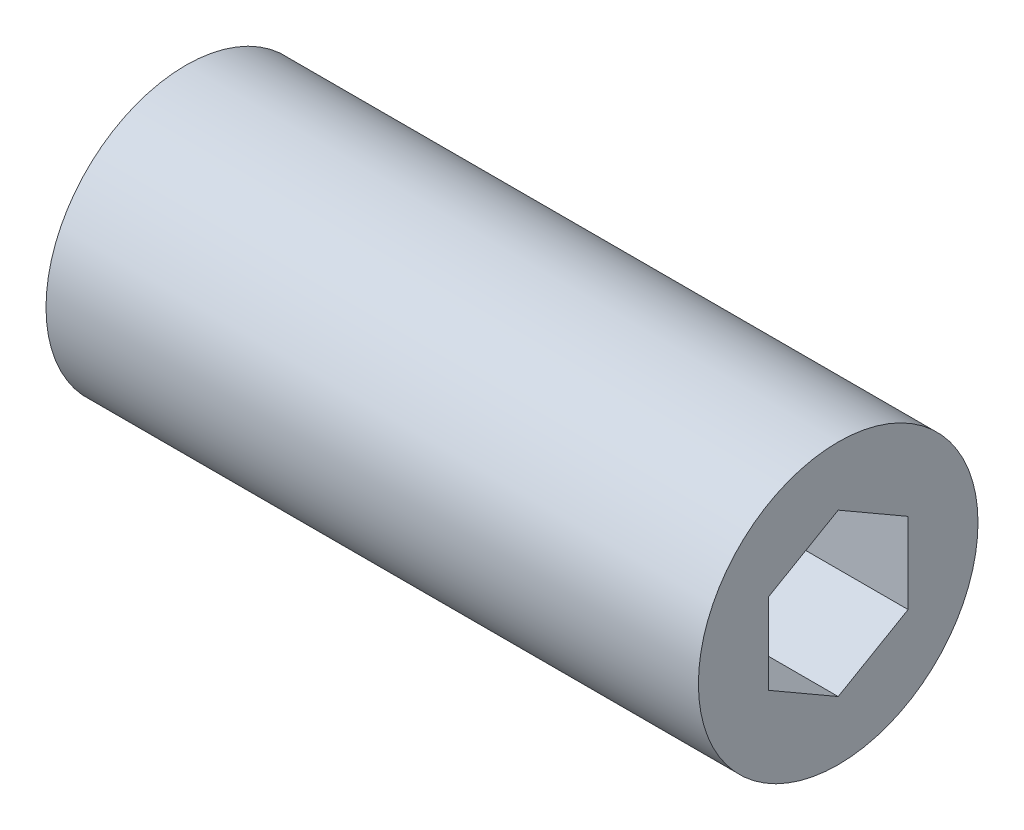
ISO-10303-21;
HEADER;
FILE_DESCRIPTION(('STEP AP214'),'2;1');
FILE_NAME('part.step','',(''),(''),'','','');
FILE_SCHEMA(('AUTOMOTIVE_DESIGN { 1 0 10303 214 1 1 1 1 }'));
ENDSEC;
DATA;
#1=APPLICATION_CONTEXT('core data for automotive mechanical design processes');
#2=APPLICATION_PROTOCOL_DEFINITION('international standard','automotive_design',2000,#1);
#3=PRODUCT_CONTEXT('',#1,'mechanical');
#4=PRODUCT('Part','Part','',(#3));
#5=PRODUCT_RELATED_PRODUCT_CATEGORY('part','',(#4));
#6=PRODUCT_DEFINITION_FORMATION('','',#4);
#7=PRODUCT_DEFINITION_CONTEXT('part definition',#1,'design');
#8=PRODUCT_DEFINITION('design','',#6,#7);
#9=PRODUCT_DEFINITION_SHAPE('','',#8);
#10=(LENGTH_UNIT() NAMED_UNIT(*) SI_UNIT(.MILLI.,.METRE.));
#11=(NAMED_UNIT(*) PLANE_ANGLE_UNIT() SI_UNIT($,.RADIAN.));
#12=(NAMED_UNIT(*) SI_UNIT($,.STERADIAN.) SOLID_ANGLE_UNIT());
#13=UNCERTAINTY_MEASURE_WITH_UNIT(LENGTH_MEASURE(1.E-05),#10,'distance_accuracy_value','');
#14=(GEOMETRIC_REPRESENTATION_CONTEXT(3) GLOBAL_UNCERTAINTY_ASSIGNED_CONTEXT((#13)) GLOBAL_UNIT_ASSIGNED_CONTEXT((#10,
#11,#12)) REPRESENTATION_CONTEXT('',''));
#15=CARTESIAN_POINT('',(0.,0.,0.));
#16=DIRECTION('',(0.,0.,1.));
#17=DIRECTION('',(1.,0.,0.));
#18=AXIS2_PLACEMENT_3D('',#15,#16,#17);
#19=CARTESIAN_POINT('',(8.3,0.,-7.));
#20=DIRECTION('',(1.,0.,0.));
#21=DIRECTION('',(0.,0.,-1.));
#22=AXIS2_PLACEMENT_3D('',#19,#20,#21);
#23=PLANE('',#22);
#24=DIRECTION('',(0.,0.49999999836129,-0.866025404730548));
#25=VECTOR('',#24,1.);
#26=CARTESIAN_POINT('',(8.3,-0.64951905,-7.375));
#27=LINE('',#26,#25);
#28=CARTESIAN_POINT('',(8.3,-0.8660254,-7.));
#29=VERTEX_POINT('',#28);
#30=CARTESIAN_POINT('',(8.3,-0.4330127,-7.75));
#31=VERTEX_POINT('',#30);
#32=EDGE_CURVE('E80',#29,#31,#27,.T.);
#33=ORIENTED_EDGE('',*,*,#32,.T.);
#34=DIRECTION('',(0.,1.,0.));
#35=VECTOR('',#34,1.);
#36=CARTESIAN_POINT('',(8.3,0.,-7.75));
#37=LINE('',#36,#35);
#38=CARTESIAN_POINT('',(8.3,0.4330127,-7.75));
#39=VERTEX_POINT('',#38);
#40=EDGE_CURVE('E64',#31,#39,#37,.T.);
#41=ORIENTED_EDGE('',*,*,#40,.T.);
#42=DIRECTION('',(0.,0.49999999836129,0.866025404730548));
#43=VECTOR('',#42,1.);
#44=CARTESIAN_POINT('',(8.3,0.64951905,-7.375));
#45=LINE('',#44,#43);
#46=CARTESIAN_POINT('',(8.3,0.8660254,-7.));
#47=VERTEX_POINT('',#46);
#48=EDGE_CURVE('E69',#39,#47,#45,.T.);
#49=ORIENTED_EDGE('',*,*,#48,.T.);
#50=DIRECTION('',(0.,-0.49999999836129,0.866025404730548));
#51=VECTOR('',#50,1.);
#52=CARTESIAN_POINT('',(8.3,0.64951905,-6.625));
#53=LINE('',#52,#51);
#54=CARTESIAN_POINT('',(8.3,0.4330127,-6.25));
#55=VERTEX_POINT('',#54);
#56=EDGE_CURVE('E103',#47,#55,#53,.T.);
#57=ORIENTED_EDGE('',*,*,#56,.T.);
#58=DIRECTION('',(0.,1.,0.));
#59=VECTOR('',#58,1.);
#60=CARTESIAN_POINT('',(8.3,0.,-6.25));
#61=LINE('',#60,#59);
#62=CARTESIAN_POINT('',(8.3,-0.4330127,-6.25));
#63=VERTEX_POINT('',#62);
#64=EDGE_CURVE('E98',#55,#63,#61,.F.);
#65=ORIENTED_EDGE('',*,*,#64,.T.);
#66=DIRECTION('',(0.,-0.49999999836129,-0.866025404730548));
#67=VECTOR('',#66,1.);
#68=CARTESIAN_POINT('',(8.3,-0.64951905,-6.625));
#69=LINE('',#68,#67);
#70=EDGE_CURVE('E94',#63,#29,#69,.T.);
#71=ORIENTED_EDGE('',*,*,#70,.T.);
#72=EDGE_LOOP('',(#33,#41,#49,#57,#65,#71));
#73=FACE_BOUND('',#72,.T.);
#74=ADVANCED_FACE('F16',(#73),#23,.T.);
#75=CARTESIAN_POINT('',(10.,0.64951905,-7.375));
#76=DIRECTION('',(0.,0.866025404730548,-0.49999999836129));
#77=DIRECTION('',(0.,0.49999999836129,0.866025404730548));
#78=AXIS2_PLACEMENT_3D('',#75,#76,#77);
#79=PLANE('',#78);
#80=DIRECTION('',(-1.,0.,0.));
#81=VECTOR('',#80,1.);
#82=CARTESIAN_POINT('',(10.,0.4330127,-7.75));
#83=LINE('',#82,#81);
#84=CARTESIAN_POINT('',(10.,0.4330127,-7.75));
#85=VERTEX_POINT('',#84);
#86=EDGE_CURVE('E71',#39,#85,#83,.F.);
#87=ORIENTED_EDGE('',*,*,#86,.T.);
#88=DIRECTION('',(0.,-0.49999999836129,-0.866025404730548));
#89=VECTOR('',#88,1.);
#90=CARTESIAN_POINT('',(10.,0.8660254,-7.));
#91=LINE('',#90,#89);
#92=CARTESIAN_POINT('',(10.,0.8660254,-7.));
#93=VERTEX_POINT('',#92);
#94=EDGE_CURVE('E105',#93,#85,#91,.T.);
#95=ORIENTED_EDGE('',*,*,#94,.F.);
#96=DIRECTION('',(1.,0.,0.));
#97=VECTOR('',#96,1.);
#98=CARTESIAN_POINT('',(10.,0.8660254,-7.));
#99=LINE('',#98,#97);
#100=EDGE_CURVE('E74',#93,#47,#99,.F.);
#101=ORIENTED_EDGE('',*,*,#100,.T.);
#102=ORIENTED_EDGE('',*,*,#48,.F.);
#103=EDGE_LOOP('',(#87,#95,#101,#102));
#104=FACE_BOUND('',#103,.T.);
#105=ADVANCED_FACE('F70',(#104),#79,.F.);
#106=CARTESIAN_POINT('',(10.,0.,-7.75));
#107=DIRECTION('',(0.,0.,-1.));
#108=DIRECTION('',(-1.,0.,0.));
#109=AXIS2_PLACEMENT_3D('',#106,#107,#108);
#110=PLANE('',#109);
#111=DIRECTION('',(1.,0.,0.));
#112=VECTOR('',#111,1.);
#113=CARTESIAN_POINT('',(10.,-0.4330127,-7.75));
#114=LINE('',#113,#112);
#115=CARTESIAN_POINT('',(10.,-0.4330127,-7.75));
#116=VERTEX_POINT('',#115);
#117=EDGE_CURVE('E82',#31,#116,#114,.T.);
#118=ORIENTED_EDGE('',*,*,#117,.T.);
#119=DIRECTION('',(0.,1.,0.));
#120=VECTOR('',#119,1.);
#121=CARTESIAN_POINT('',(10.,0.,-7.75));
#122=LINE('',#121,#120);
#123=EDGE_CURVE('E86',#85,#116,#122,.F.);
#124=ORIENTED_EDGE('',*,*,#123,.F.);
#125=ORIENTED_EDGE('',*,*,#86,.F.);
#126=ORIENTED_EDGE('',*,*,#40,.F.);
#127=EDGE_LOOP('',(#118,#124,#125,#126));
#128=FACE_BOUND('',#127,.T.);
#129=ADVANCED_FACE('F84',(#128),#110,.F.);
#130=CARTESIAN_POINT('',(10.,-0.64951905,-7.375));
#131=DIRECTION('',(0.,-0.866025404730548,-0.49999999836129));
#132=DIRECTION('',(0.,0.49999999836129,-0.866025404730548));
#133=AXIS2_PLACEMENT_3D('',#130,#131,#132);
#134=PLANE('',#133);
#135=DIRECTION('',(1.,0.,0.));
#136=VECTOR('',#135,1.);
#137=CARTESIAN_POINT('',(10.,-0.8660254,-7.));
#138=LINE('',#137,#136);
#139=CARTESIAN_POINT('',(10.,-0.8660254,-7.));
#140=VERTEX_POINT('',#139);
#141=EDGE_CURVE('E92',#29,#140,#138,.T.);
#142=ORIENTED_EDGE('',*,*,#141,.T.);
#143=DIRECTION('',(0.,-0.49999999836129,0.866025404730548));
#144=VECTOR('',#143,1.);
#145=CARTESIAN_POINT('',(10.,-0.4330127,-7.75));
#146=LINE('',#145,#144);
#147=EDGE_CURVE('E108',#116,#140,#146,.T.);
#148=ORIENTED_EDGE('',*,*,#147,.F.);
#149=ORIENTED_EDGE('',*,*,#117,.F.);
#150=ORIENTED_EDGE('',*,*,#32,.F.);
#151=EDGE_LOOP('',(#142,#148,#149,#150));
#152=FACE_BOUND('',#151,.T.);
#153=ADVANCED_FACE('F195',(#152),#134,.F.);
#154=CARTESIAN_POINT('',(10.,-0.64951905,-6.625));
#155=DIRECTION('',(0.,-0.866025404730548,0.49999999836129));
#156=DIRECTION('',(0.,-0.49999999836129,-0.866025404730548));
#157=AXIS2_PLACEMENT_3D('',#154,#155,#156);
#158=PLANE('',#157);
#159=DIRECTION('',(1.,0.,0.));
#160=VECTOR('',#159,1.);
#161=CARTESIAN_POINT('',(10.,-0.4330127,-6.25));
#162=LINE('',#161,#160);
#163=CARTESIAN_POINT('',(10.,-0.4330127,-6.25));
#164=VERTEX_POINT('',#163);
#165=EDGE_CURVE('E96',#63,#164,#162,.T.);
#166=ORIENTED_EDGE('',*,*,#165,.T.);
#167=DIRECTION('',(0.,0.49999999836129,0.866025404730548));
#168=VECTOR('',#167,1.);
#169=CARTESIAN_POINT('',(10.,-0.8660254,-7.));
#170=LINE('',#169,#168);
#171=EDGE_CURVE('E111',#140,#164,#170,.T.);
#172=ORIENTED_EDGE('',*,*,#171,.F.);
#173=ORIENTED_EDGE('',*,*,#141,.F.);
#174=ORIENTED_EDGE('',*,*,#70,.F.);
#175=EDGE_LOOP('',(#166,#172,#173,#174));
#176=FACE_BOUND('',#175,.T.);
#177=ADVANCED_FACE('F183',(#176),#158,.F.);
#178=CARTESIAN_POINT('',(10.,0.,-6.25));
#179=DIRECTION('',(0.,0.,1.));
#180=DIRECTION('',(1.,0.,0.));
#181=AXIS2_PLACEMENT_3D('',#178,#179,#180);
#182=PLANE('',#181);
#183=DIRECTION('',(1.,0.,0.));
#184=VECTOR('',#183,1.);
#185=CARTESIAN_POINT('',(10.,0.4330127,-6.25));
#186=LINE('',#185,#184);
#187=CARTESIAN_POINT('',(10.,0.4330127,-6.25));
#188=VERTEX_POINT('',#187);
#189=EDGE_CURVE('E32',#55,#188,#186,.T.);
#190=ORIENTED_EDGE('',*,*,#189,.T.);
#191=DIRECTION('',(0.,1.,0.));
#192=VECTOR('',#191,1.);
#193=CARTESIAN_POINT('',(10.,0.,-6.25));
#194=LINE('',#193,#192);
#195=EDGE_CURVE('E114',#164,#188,#194,.T.);
#196=ORIENTED_EDGE('',*,*,#195,.F.);
#197=ORIENTED_EDGE('',*,*,#165,.F.);
#198=ORIENTED_EDGE('',*,*,#64,.F.);
#199=EDGE_LOOP('',(#190,#196,#197,#198));
#200=FACE_BOUND('',#199,.T.);
#201=ADVANCED_FACE('F139',(#200),#182,.F.);
#202=CARTESIAN_POINT('',(10.,0.64951905,-6.625));
#203=DIRECTION('',(0.,0.866025404730548,0.49999999836129));
#204=DIRECTION('',(0.,-0.49999999836129,0.866025404730548));
#205=AXIS2_PLACEMENT_3D('',#202,#203,#204);
#206=PLANE('',#205);
#207=ORIENTED_EDGE('',*,*,#100,.F.);
#208=DIRECTION('',(0.,0.49999999836129,-0.866025404730548));
#209=VECTOR('',#208,1.);
#210=CARTESIAN_POINT('',(10.,0.4330127,-6.25));
#211=LINE('',#210,#209);
#212=EDGE_CURVE('E117',#188,#93,#211,.T.);
#213=ORIENTED_EDGE('',*,*,#212,.F.);
#214=ORIENTED_EDGE('',*,*,#189,.F.);
#215=ORIENTED_EDGE('',*,*,#56,.F.);
#216=EDGE_LOOP('',(#207,#213,#214,#215));
#217=FACE_BOUND('',#216,.T.);
#218=ADVANCED_FACE('F129',(#217),#206,.F.);
#219=CARTESIAN_POINT('',(3.,0.,-7.75));
#220=DIRECTION('',(-1.,0.,0.));
#221=DIRECTION('',(0.,0.,1.));
#222=AXIS2_PLACEMENT_3D('',#219,#220,#221);
#223=PLANE('',#222);
#224=CARTESIAN_POINT('',(3.,0.,-7.));
#225=DIRECTION('',(1.,0.,0.));
#226=DIRECTION('',(0.,0.,-1.));
#227=AXIS2_PLACEMENT_3D('',#224,#225,#226);
#228=CIRCLE('',#227,1.5);
#229=CARTESIAN_POINT('',(3.,0.,-8.5));
#230=VERTEX_POINT('',#229);
#231=EDGE_CURVE('E19',#230,#230,#228,.T.);
#232=ORIENTED_EDGE('',*,*,#231,.F.);
#233=EDGE_LOOP('',(#232));
#234=FACE_BOUND('',#233,.T.);
#235=ADVANCED_FACE('F126',(#234),#223,.T.);
#236=CARTESIAN_POINT('',(10.,0.,-7.75));
#237=DIRECTION('',(1.,0.,0.));
#238=DIRECTION('',(0.,0.,-1.));
#239=AXIS2_PLACEMENT_3D('',#236,#237,#238);
#240=PLANE('',#239);
#241=CARTESIAN_POINT('',(10.,0.,-7.));
#242=DIRECTION('',(1.,0.,0.));
#243=DIRECTION('',(0.,0.,-1.));
#244=AXIS2_PLACEMENT_3D('',#241,#242,#243);
#245=CIRCLE('',#244,1.5);
#246=CARTESIAN_POINT('',(10.,0.,-8.5));
#247=VERTEX_POINT('',#246);
#248=EDGE_CURVE('E11',#247,#247,#245,.F.);
#249=ORIENTED_EDGE('',*,*,#248,.F.);
#250=EDGE_LOOP('',(#249));
#251=FACE_BOUND('',#250,.T.);
#252=ORIENTED_EDGE('',*,*,#195,.T.);
#253=ORIENTED_EDGE('',*,*,#212,.T.);
#254=ORIENTED_EDGE('',*,*,#94,.T.);
#255=ORIENTED_EDGE('',*,*,#123,.T.);
#256=ORIENTED_EDGE('',*,*,#147,.T.);
#257=ORIENTED_EDGE('',*,*,#171,.T.);
#258=EDGE_LOOP('',(#252,#253,#254,#255,#256,#257));
#259=FACE_BOUND('',#258,.T.);
#260=ADVANCED_FACE('F128',(#251,#259),#240,.T.);
#261=CARTESIAN_POINT('',(6.5,0.,-7.));
#262=DIRECTION('',(1.,0.,0.));
#263=DIRECTION('',(0.,0.,-1.));
#264=AXIS2_PLACEMENT_3D('',#261,#262,#263);
#265=CYLINDRICAL_SURFACE('',#264,1.5);
#266=ORIENTED_EDGE('',*,*,#231,.T.);
#267=EDGE_LOOP('',(#266));
#268=FACE_BOUND('',#267,.T.);
#269=ORIENTED_EDGE('',*,*,#248,.T.);
#270=EDGE_LOOP('',(#269));
#271=FACE_BOUND('',#270,.T.);
#272=ADVANCED_FACE('F123',(#268,#271),#265,.T.);
#273=CLOSED_SHELL('',(#74,#105,#129,#153,#177,#201,#218,#235,#260,#272));
#274=MANIFOLD_SOLID_BREP('B1',#273);
#275=ADVANCED_BREP_SHAPE_REPRESENTATION('',(#18,#274),#14);
#276=SHAPE_DEFINITION_REPRESENTATION(#9,#275);
ENDSEC;
END-ISO-10303-21;
